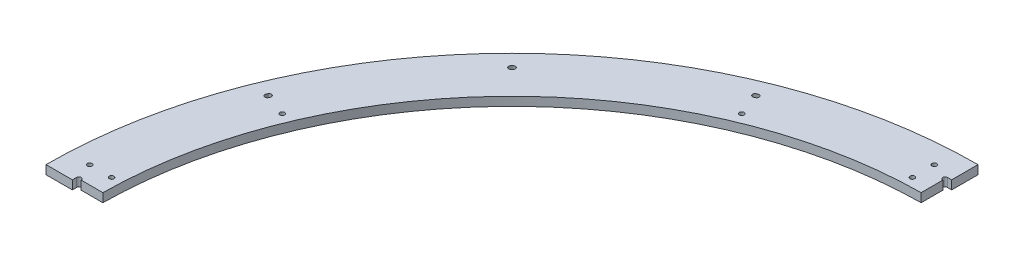
ISO-10303-21;
HEADER;
FILE_DESCRIPTION(('STEP AP214'),'2;1');
FILE_NAME('part.step','',(''),(''),'','','');
FILE_SCHEMA(('AUTOMOTIVE_DESIGN { 1 0 10303 214 1 1 1 1 }'));
ENDSEC;
DATA;
#1=APPLICATION_CONTEXT('core data for automotive mechanical design processes');
#2=APPLICATION_PROTOCOL_DEFINITION('international standard','automotive_design',2000,#1);
#3=PRODUCT_CONTEXT('',#1,'mechanical');
#4=PRODUCT('Part','Part','',(#3));
#5=PRODUCT_RELATED_PRODUCT_CATEGORY('part','',(#4));
#6=PRODUCT_DEFINITION_FORMATION('','',#4);
#7=PRODUCT_DEFINITION_CONTEXT('part definition',#1,'design');
#8=PRODUCT_DEFINITION('design','',#6,#7);
#9=PRODUCT_DEFINITION_SHAPE('','',#8);
#10=(LENGTH_UNIT() NAMED_UNIT(*) SI_UNIT(.MILLI.,.METRE.));
#11=(NAMED_UNIT(*) PLANE_ANGLE_UNIT() SI_UNIT($,.RADIAN.));
#12=(NAMED_UNIT(*) SI_UNIT($,.STERADIAN.) SOLID_ANGLE_UNIT());
#13=UNCERTAINTY_MEASURE_WITH_UNIT(LENGTH_MEASURE(1.E-05),#10,'distance_accuracy_value','');
#14=(GEOMETRIC_REPRESENTATION_CONTEXT(3) GLOBAL_UNCERTAINTY_ASSIGNED_CONTEXT((#13)) GLOBAL_UNIT_ASSIGNED_CONTEXT((#10,
#11,#12)) REPRESENTATION_CONTEXT('',''));
#15=CARTESIAN_POINT('',(0.,0.,0.));
#16=DIRECTION('',(0.,0.,1.));
#17=DIRECTION('',(1.,0.,0.));
#18=AXIS2_PLACEMENT_3D('',#15,#16,#17);
#19=CARTESIAN_POINT('',(0.,12.7,0.));
#20=DIRECTION('',(0.,-1.,0.));
#21=DIRECTION('',(0.,0.,-1.));
#22=AXIS2_PLACEMENT_3D('',#19,#20,#21);
#23=PLANE('',#22);
#24=CARTESIAN_POINT('',(0.,12.7,0.));
#25=DIRECTION('',(0.,1.,0.));
#26=DIRECTION('',(0.,0.,1.));
#27=AXIS2_PLACEMENT_3D('',#24,#25,#26);
#28=CIRCLE('',#27,652.6657);
#29=CARTESIAN_POINT('',(-602.990490798011,12.7,-249.749842770047));
#30=VERTEX_POINT('',#29);
#31=CARTESIAN_POINT('',(-603.807939634826,12.7,-247.767003433541));
#32=VERTEX_POINT('',#31);
#33=EDGE_CURVE('E211',#30,#32,#28,.T.);
#34=ORIENTED_EDGE('',*,*,#33,.F.);
#35=CARTESIAN_POINT('',(-599.869409858698,12.7,-248.457136689666));
#36=DIRECTION('',(0.,1.,0.));
#37=DIRECTION('',(0.,0.,1.));
#38=AXIS2_PLACEMENT_3D('',#35,#36,#37);
#39=CIRCLE('',#38,3.37820000000002);
#40=CARTESIAN_POINT('',(-596.748328919384,12.7,-247.164430609286));
#41=VERTEX_POINT('',#40);
#42=EDGE_CURVE('E47',#41,#30,#39,.T.);
#43=ORIENTED_EDGE('',*,*,#42,.F.);
#44=CARTESIAN_POINT('',(0.,12.7,0.));
#45=DIRECTION('',(0.,-1.,0.));
#46=DIRECTION('',(0.,0.,1.));
#47=AXIS2_PLACEMENT_3D('',#44,#45,#46);
#48=CIRCLE('',#47,645.9093);
#49=CARTESIAN_POINT('',(-597.557315519986,12.7,-245.20211763979));
#50=VERTEX_POINT('',#49);
#51=EDGE_CURVE('E202',#50,#41,#48,.T.);
#52=ORIENTED_EDGE('',*,*,#51,.F.);
#53=CARTESIAN_POINT('',(-600.682627577406,12.7,-246.484560536666));
#54=DIRECTION('',(0.,1.,0.));
#55=DIRECTION('',(0.,0.,1.));
#56=AXIS2_PLACEMENT_3D('',#53,#54,#55);
#57=CIRCLE('',#56,3.37819999999996);
#58=EDGE_CURVE('E205',#32,#50,#57,.T.);
#59=ORIENTED_EDGE('',*,*,#58,.F.);
#60=EDGE_LOOP('',(#34,#43,#52,#59));
#61=FACE_BOUND('',#60,.T.);
#62=CARTESIAN_POINT('',(0.,12.7,0.));
#63=DIRECTION('',(0.,1.,0.));
#64=DIRECTION('',(0.,0.,1.));
#65=AXIS2_PLACEMENT_3D('',#62,#63,#64);
#66=CIRCLE('',#65,652.6657);
#67=CARTESIAN_POINT('',(-460.745442176767,12.7,-462.261996566693));
#68=VERTEX_POINT('',#67);
#69=CARTESIAN_POINT('',(-462.261996566693,12.7,-460.745442176767));
#70=VERTEX_POINT('',#69);
#71=EDGE_CURVE('E237',#68,#70,#66,.T.);
#72=ORIENTED_EDGE('',*,*,#71,.F.);
#73=CARTESIAN_POINT('',(-458.360622118411,12.7,-459.869326817384));
#74=DIRECTION('',(0.,1.,0.));
#75=DIRECTION('',(0.,0.,1.));
#76=AXIS2_PLACEMENT_3D('',#73,#74,#75);
#77=CIRCLE('',#76,3.37819999999989);
#78=CARTESIAN_POINT('',(-455.975802060054,12.7,-457.476657068075));
#79=VERTEX_POINT('',#78);
#80=EDGE_CURVE('E55',#79,#68,#77,.T.);
#81=ORIENTED_EDGE('',*,*,#80,.F.);
#82=CARTESIAN_POINT('',(0.,12.7,0.));
#83=DIRECTION('',(0.,-1.,0.));
#84=DIRECTION('',(0.,0.,1.));
#85=AXIS2_PLACEMENT_3D('',#82,#83,#84);
#86=CIRCLE('',#85,645.9093);
#87=CARTESIAN_POINT('',(-457.476657068075,12.7,-455.975802060054));
#88=VERTEX_POINT('',#87);
#89=EDGE_CURVE('E226',#88,#79,#86,.T.);
#90=ORIENTED_EDGE('',*,*,#89,.F.);
#91=CARTESIAN_POINT('',(-459.869326817384,12.7,-458.360622118411));
#92=DIRECTION('',(0.,1.,0.));
#93=DIRECTION('',(0.,0.,1.));
#94=AXIS2_PLACEMENT_3D('',#91,#92,#93);
#95=CIRCLE('',#94,3.37819999999989);
#96=EDGE_CURVE('E241',#70,#88,#95,.T.);
#97=ORIENTED_EDGE('',*,*,#96,.F.);
#98=EDGE_LOOP('',(#72,#81,#90,#97));
#99=FACE_BOUND('',#98,.T.);
#100=CARTESIAN_POINT('',(0.,12.7,0.));
#101=DIRECTION('',(0.,1.,0.));
#102=DIRECTION('',(0.,0.,1.));
#103=AXIS2_PLACEMENT_3D('',#100,#101,#102);
#104=CIRCLE('',#103,652.6657);
#105=CARTESIAN_POINT('',(-247.767003433541,12.7,-603.807939634826));
#106=VERTEX_POINT('',#105);
#107=CARTESIAN_POINT('',(-249.749842770047,12.7,-602.990490798011));
#108=VERTEX_POINT('',#107);
#109=EDGE_CURVE('E268',#106,#108,#104,.T.);
#110=ORIENTED_EDGE('',*,*,#109,.F.);
#111=CARTESIAN_POINT('',(-246.484560536666,12.7,-600.682627577406));
#112=DIRECTION('',(0.,1.,0.));
#113=DIRECTION('',(0.,0.,1.));
#114=AXIS2_PLACEMENT_3D('',#111,#112,#113);
#115=CIRCLE('',#114,3.37819999999987);
#116=CARTESIAN_POINT('',(-245.202117639791,12.7,-597.557315519986));
#117=VERTEX_POINT('',#116);
#118=EDGE_CURVE('E266',#117,#106,#115,.T.);
#119=ORIENTED_EDGE('',*,*,#118,.F.);
#120=CARTESIAN_POINT('',(0.,12.7,0.));
#121=DIRECTION('',(0.,-1.,0.));
#122=DIRECTION('',(0.,0.,1.));
#123=AXIS2_PLACEMENT_3D('',#120,#121,#122);
#124=CIRCLE('',#123,645.9093);
#125=CARTESIAN_POINT('',(-247.164430609286,12.7,-596.748328919384));
#126=VERTEX_POINT('',#125);
#127=EDGE_CURVE('E256',#126,#117,#124,.T.);
#128=ORIENTED_EDGE('',*,*,#127,.F.);
#129=CARTESIAN_POINT('',(-248.457136689666,12.7,-599.869409858698));
#130=DIRECTION('',(0.,1.,0.));
#131=DIRECTION('',(0.,0.,1.));
#132=AXIS2_PLACEMENT_3D('',#129,#130,#131);
#133=CIRCLE('',#132,3.3781999999999);
#134=EDGE_CURVE('E271',#108,#126,#133,.T.);
#135=ORIENTED_EDGE('',*,*,#134,.F.);
#136=EDGE_LOOP('',(#110,#119,#128,#135));
#137=FACE_BOUND('',#136,.T.);
#138=CARTESIAN_POINT('',(-31.75,12.7,-642.9375));
#139=DIRECTION('',(0.,1.,0.));
#140=DIRECTION('',(0.,0.,1.));
#141=AXIS2_PLACEMENT_3D('',#138,#139,#140);
#142=CIRCLE('',#141,3.3782);
#143=CARTESIAN_POINT('',(-31.75,12.7,-639.5593));
#144=VERTEX_POINT('',#143);
#145=EDGE_CURVE('E303',#144,#144,#142,.T.);
#146=ORIENTED_EDGE('',*,*,#145,.F.);
#147=EDGE_LOOP('',(#146));
#148=FACE_BOUND('',#147,.T.);
#149=CARTESIAN_POINT('',(-31.75,12.7,-611.1875));
#150=DIRECTION('',(0.,1.,0.));
#151=DIRECTION('',(0.,0.,1.));
#152=AXIS2_PLACEMENT_3D('',#149,#150,#151);
#153=CIRCLE('',#152,3.3782);
#154=CARTESIAN_POINT('',(-31.75,12.7,-607.8093));
#155=VERTEX_POINT('',#154);
#156=EDGE_CURVE('E309',#155,#155,#153,.T.);
#157=ORIENTED_EDGE('',*,*,#156,.F.);
#158=EDGE_LOOP('',(#157));
#159=FACE_BOUND('',#158,.T.);
#160=CARTESIAN_POINT('',(-611.1875,12.7,-31.75));
#161=DIRECTION('',(0.,1.,0.));
#162=DIRECTION('',(0.,0.,1.));
#163=AXIS2_PLACEMENT_3D('',#160,#161,#162);
#164=CIRCLE('',#163,3.3782);
#165=CARTESIAN_POINT('',(-611.1875,12.7,-28.3718));
#166=VERTEX_POINT('',#165);
#167=EDGE_CURVE('E315',#166,#166,#164,.T.);
#168=ORIENTED_EDGE('',*,*,#167,.F.);
#169=EDGE_LOOP('',(#168));
#170=FACE_BOUND('',#169,.T.);
#171=CARTESIAN_POINT('',(-642.9375,12.7,-31.75));
#172=DIRECTION('',(0.,1.,0.));
#173=DIRECTION('',(0.,0.,1.));
#174=AXIS2_PLACEMENT_3D('',#171,#172,#173);
#175=CIRCLE('',#174,3.3782);
#176=CARTESIAN_POINT('',(-642.9375,12.7,-28.3718));
#177=VERTEX_POINT('',#176);
#178=EDGE_CURVE('E321',#177,#177,#175,.T.);
#179=ORIENTED_EDGE('',*,*,#178,.F.);
#180=EDGE_LOOP('',(#179));
#181=FACE_BOUND('',#180,.T.);
#182=CARTESIAN_POINT('',(-567.596939292465,12.7,-235.106350216397));
#183=DIRECTION('',(0.,1.,0.));
#184=DIRECTION('',(0.,0.,1.));
#185=AXIS2_PLACEMENT_3D('',#182,#183,#184);
#186=CIRCLE('',#185,3.3782);
#187=CARTESIAN_POINT('',(-567.596939292465,12.7,-231.728150216397));
#188=VERTEX_POINT('',#187);
#189=EDGE_CURVE('E327',#188,#188,#186,.T.);
#190=ORIENTED_EDGE('',*,*,#189,.F.);
#191=EDGE_LOOP('',(#190));
#192=FACE_BOUND('',#191,.T.);
#193=CARTESIAN_POINT('',(-235.106350216398,12.7,-567.596939292465));
#194=DIRECTION('',(0.,1.,0.));
#195=DIRECTION('',(0.,0.,1.));
#196=AXIS2_PLACEMENT_3D('',#193,#194,#195);
#197=CIRCLE('',#196,3.3782);
#198=CARTESIAN_POINT('',(-235.106350216398,12.7,-564.218739292465));
#199=VERTEX_POINT('',#198);
#200=EDGE_CURVE('E333',#199,#199,#197,.T.);
#201=ORIENTED_EDGE('',*,*,#200,.F.);
#202=EDGE_LOOP('',(#201));
#203=FACE_BOUND('',#202,.T.);
#204=DIRECTION('',(-1.,0.,0.));
#205=VECTOR('',#204,1.);
#206=CARTESIAN_POINT('',(-6.35,12.7,-636.5875));
#207=LINE('',#206,#205);
#208=CARTESIAN_POINT('',(-0.317499999999959,12.7,-636.5875));
#209=VERTEX_POINT('',#208);
#210=CARTESIAN_POINT('',(-6.35,12.7,-636.5875));
#211=VERTEX_POINT('',#210);
#212=EDGE_CURVE('E356',#209,#211,#207,.T.);
#213=ORIENTED_EDGE('',*,*,#212,.F.);
#214=DIRECTION('',(0.,0.,1.));
#215=VECTOR('',#214,1.);
#216=CARTESIAN_POINT('',(-0.317499999999959,12.7,-674.6875));
#217=LINE('',#216,#215);
#218=CARTESIAN_POINT('',(-0.317499999999959,12.7,-674.687425294113));
#219=VERTEX_POINT('',#218);
#220=EDGE_CURVE('E287',#219,#209,#217,.T.);
#221=ORIENTED_EDGE('',*,*,#220,.F.);
#222=CARTESIAN_POINT('',(0.,12.7,0.));
#223=DIRECTION('',(0.,1.,0.));
#224=DIRECTION('',(0.,0.,-1.));
#225=AXIS2_PLACEMENT_3D('',#222,#223,#224);
#226=CIRCLE('',#225,674.6875);
#227=CARTESIAN_POINT('',(-674.687425294113,12.7,-0.317499999999971));
#228=VERTEX_POINT('',#227);
#229=EDGE_CURVE('E40',#219,#228,#226,.T.);
#230=ORIENTED_EDGE('',*,*,#229,.T.);
#231=DIRECTION('',(-1.,0.,0.));
#232=VECTOR('',#231,1.);
#233=CARTESIAN_POINT('',(-674.6875,12.7,-0.317499999999971));
#234=LINE('',#233,#232);
#235=CARTESIAN_POINT('',(-636.5875,12.7,-0.317500000000082));
#236=VERTEX_POINT('',#235);
#237=EDGE_CURVE('E218',#236,#228,#234,.T.);
#238=ORIENTED_EDGE('',*,*,#237,.F.);
#239=DIRECTION('',(0.,0.,1.));
#240=VECTOR('',#239,1.);
#241=CARTESIAN_POINT('',(-636.5875,12.7,6.35000000000012));
#242=LINE('',#241,#240);
#243=CARTESIAN_POINT('',(-636.5875,12.7,-6.34999999999988));
#244=VERTEX_POINT('',#243);
#245=EDGE_CURVE('E373',#244,#236,#242,.T.);
#246=ORIENTED_EDGE('',*,*,#245,.F.);
#247=CARTESIAN_POINT('',(-633.1585,12.7,-6.34999999999988));
#248=DIRECTION('',(0.,1.,0.));
#249=DIRECTION('',(0.,0.,1.));
#250=AXIS2_PLACEMENT_3D('',#247,#248,#249);
#251=CIRCLE('',#250,3.429);
#252=CARTESIAN_POINT('',(-629.7295,12.7,-6.34999999999988));
#253=VERTEX_POINT('',#252);
#254=EDGE_CURVE('E344',#253,#244,#251,.T.);
#255=ORIENTED_EDGE('',*,*,#254,.F.);
#256=DIRECTION('',(-1.,0.,0.));
#257=VECTOR('',#256,1.);
#258=CARTESIAN_POINT('',(-598.453812049226,12.7,-6.34999999999989));
#259=LINE('',#258,#257);
#260=CARTESIAN_POINT('',(-598.453812049226,12.7,-6.34999999999989));
#261=VERTEX_POINT('',#260);
#262=EDGE_CURVE('E352',#261,#253,#259,.T.);
#263=ORIENTED_EDGE('',*,*,#262,.F.);
#264=CARTESIAN_POINT('',(0.,12.7,0.));
#265=DIRECTION('',(0.,-1.,0.));
#266=DIRECTION('',(0.,0.,-1.));
#267=AXIS2_PLACEMENT_3D('',#264,#265,#266);
#268=CIRCLE('',#267,598.4875);
#269=CARTESIAN_POINT('',(-6.35,12.7,-598.453812049226));
#270=VERTEX_POINT('',#269);
#271=EDGE_CURVE('E384',#261,#270,#268,.T.);
#272=ORIENTED_EDGE('',*,*,#271,.T.);
#273=DIRECTION('',(0.,0.,1.));
#274=VECTOR('',#273,1.);
#275=CARTESIAN_POINT('',(-6.35,12.7,-598.453812049226));
#276=LINE('',#275,#274);
#277=CARTESIAN_POINT('',(-6.35,12.7,-629.7295));
#278=VERTEX_POINT('',#277);
#279=EDGE_CURVE('E359',#278,#270,#276,.T.);
#280=ORIENTED_EDGE('',*,*,#279,.F.);
#281=CARTESIAN_POINT('',(-6.35,12.7,-633.1585));
#282=DIRECTION('',(0.,1.,0.));
#283=DIRECTION('',(0.,0.,1.));
#284=AXIS2_PLACEMENT_3D('',#281,#282,#283);
#285=CIRCLE('',#284,3.429);
#286=EDGE_CURVE('E346',#211,#278,#285,.T.);
#287=ORIENTED_EDGE('',*,*,#286,.F.);
#288=EDGE_LOOP('',(#213,#221,#230,#238,#246,#255,#263,#272,#280,#287));
#289=FACE_BOUND('',#288,.T.);
#290=ADVANCED_FACE('F32',(#61,#99,#137,#148,#159,#170,#181,#192,#203,#289),#23,.F.);
#291=CARTESIAN_POINT('',(0.,0.,0.));
#292=DIRECTION('',(0.,-1.,0.));
#293=DIRECTION('',(0.,0.,-1.));
#294=AXIS2_PLACEMENT_3D('',#291,#292,#293);
#295=PLANE('',#294);
#296=CARTESIAN_POINT('',(-599.869409858698,0.,-248.457136689666));
#297=DIRECTION('',(0.,1.,0.));
#298=DIRECTION('',(0.,0.,1.));
#299=AXIS2_PLACEMENT_3D('',#296,#297,#298);
#300=CIRCLE('',#299,3.37820000000002);
#301=CARTESIAN_POINT('',(-596.748328919384,0.,-247.164430609286));
#302=VERTEX_POINT('',#301);
#303=CARTESIAN_POINT('',(-602.990490798011,0.,-249.749842770047));
#304=VERTEX_POINT('',#303);
#305=EDGE_CURVE('E183',#302,#304,#300,.T.);
#306=ORIENTED_EDGE('',*,*,#305,.T.);
#307=CARTESIAN_POINT('',(0.,0.,0.));
#308=DIRECTION('',(0.,1.,0.));
#309=DIRECTION('',(0.,0.,1.));
#310=AXIS2_PLACEMENT_3D('',#307,#308,#309);
#311=CIRCLE('',#310,652.6657);
#312=CARTESIAN_POINT('',(-603.807939634826,0.,-247.767003433541));
#313=VERTEX_POINT('',#312);
#314=EDGE_CURVE('E193',#304,#313,#311,.T.);
#315=ORIENTED_EDGE('',*,*,#314,.T.);
#316=CARTESIAN_POINT('',(-600.682627577406,0.,-246.484560536666));
#317=DIRECTION('',(0.,1.,0.));
#318=DIRECTION('',(0.,0.,1.));
#319=AXIS2_PLACEMENT_3D('',#316,#317,#318);
#320=CIRCLE('',#319,3.37819999999996);
#321=CARTESIAN_POINT('',(-597.557315519986,0.,-245.20211763979));
#322=VERTEX_POINT('',#321);
#323=EDGE_CURVE('E197',#313,#322,#320,.T.);
#324=ORIENTED_EDGE('',*,*,#323,.T.);
#325=CARTESIAN_POINT('',(0.,0.,0.));
#326=DIRECTION('',(0.,-1.,0.));
#327=DIRECTION('',(0.,0.,1.));
#328=AXIS2_PLACEMENT_3D('',#325,#326,#327);
#329=CIRCLE('',#328,645.9093);
#330=EDGE_CURVE('E189',#322,#302,#329,.T.);
#331=ORIENTED_EDGE('',*,*,#330,.T.);
#332=EDGE_LOOP('',(#306,#315,#324,#331));
#333=FACE_BOUND('',#332,.T.);
#334=CARTESIAN_POINT('',(-458.360622118411,0.,-459.869326817384));
#335=DIRECTION('',(0.,1.,0.));
#336=DIRECTION('',(0.,0.,1.));
#337=AXIS2_PLACEMENT_3D('',#334,#335,#336);
#338=CIRCLE('',#337,3.37819999999989);
#339=CARTESIAN_POINT('',(-455.975802060054,0.,-457.476657068075));
#340=VERTEX_POINT('',#339);
#341=CARTESIAN_POINT('',(-460.745442176767,0.,-462.261996566693));
#342=VERTEX_POINT('',#341);
#343=EDGE_CURVE('E222',#340,#342,#338,.T.);
#344=ORIENTED_EDGE('',*,*,#343,.T.);
#345=CARTESIAN_POINT('',(0.,0.,0.));
#346=DIRECTION('',(0.,1.,0.));
#347=DIRECTION('',(0.,0.,1.));
#348=AXIS2_PLACEMENT_3D('',#345,#346,#347);
#349=CIRCLE('',#348,652.6657);
#350=CARTESIAN_POINT('',(-462.261996566693,0.,-460.745442176767));
#351=VERTEX_POINT('',#350);
#352=EDGE_CURVE('E225',#342,#351,#349,.T.);
#353=ORIENTED_EDGE('',*,*,#352,.T.);
#354=CARTESIAN_POINT('',(-459.869326817384,0.,-458.360622118411));
#355=DIRECTION('',(0.,1.,0.));
#356=DIRECTION('',(0.,0.,1.));
#357=AXIS2_PLACEMENT_3D('',#354,#355,#356);
#358=CIRCLE('',#357,3.37819999999989);
#359=CARTESIAN_POINT('',(-457.476657068075,0.,-455.975802060054));
#360=VERTEX_POINT('',#359);
#361=EDGE_CURVE('E229',#351,#360,#358,.T.);
#362=ORIENTED_EDGE('',*,*,#361,.T.);
#363=CARTESIAN_POINT('',(0.,0.,0.));
#364=DIRECTION('',(0.,-1.,0.));
#365=DIRECTION('',(0.,0.,1.));
#366=AXIS2_PLACEMENT_3D('',#363,#364,#365);
#367=CIRCLE('',#366,645.9093);
#368=EDGE_CURVE('E232',#360,#340,#367,.T.);
#369=ORIENTED_EDGE('',*,*,#368,.T.);
#370=EDGE_LOOP('',(#344,#353,#362,#369));
#371=FACE_BOUND('',#370,.T.);
#372=CARTESIAN_POINT('',(-246.484560536666,0.,-600.682627577406));
#373=DIRECTION('',(0.,1.,0.));
#374=DIRECTION('',(0.,0.,1.));
#375=AXIS2_PLACEMENT_3D('',#372,#373,#374);
#376=CIRCLE('',#375,3.37819999999987);
#377=CARTESIAN_POINT('',(-245.202117639791,0.,-597.557315519986));
#378=VERTEX_POINT('',#377);
#379=CARTESIAN_POINT('',(-247.767003433541,0.,-603.807939634826));
#380=VERTEX_POINT('',#379);
#381=EDGE_CURVE('E252',#378,#380,#376,.T.);
#382=ORIENTED_EDGE('',*,*,#381,.T.);
#383=CARTESIAN_POINT('',(0.,0.,0.));
#384=DIRECTION('',(0.,1.,0.));
#385=DIRECTION('',(0.,0.,1.));
#386=AXIS2_PLACEMENT_3D('',#383,#384,#385);
#387=CIRCLE('',#386,652.6657);
#388=CARTESIAN_POINT('',(-249.749842770047,0.,-602.990490798011));
#389=VERTEX_POINT('',#388);
#390=EDGE_CURVE('E255',#380,#389,#387,.T.);
#391=ORIENTED_EDGE('',*,*,#390,.T.);
#392=CARTESIAN_POINT('',(-248.457136689666,0.,-599.869409858698));
#393=DIRECTION('',(0.,1.,0.));
#394=DIRECTION('',(0.,0.,1.));
#395=AXIS2_PLACEMENT_3D('',#392,#393,#394);
#396=CIRCLE('',#395,3.3781999999999);
#397=CARTESIAN_POINT('',(-247.164430609286,0.,-596.748328919384));
#398=VERTEX_POINT('',#397);
#399=EDGE_CURVE('E259',#389,#398,#396,.T.);
#400=ORIENTED_EDGE('',*,*,#399,.T.);
#401=CARTESIAN_POINT('',(0.,0.,0.));
#402=DIRECTION('',(0.,-1.,0.));
#403=DIRECTION('',(0.,0.,1.));
#404=AXIS2_PLACEMENT_3D('',#401,#402,#403);
#405=CIRCLE('',#404,645.9093);
#406=EDGE_CURVE('E262',#398,#378,#405,.T.);
#407=ORIENTED_EDGE('',*,*,#406,.T.);
#408=EDGE_LOOP('',(#382,#391,#400,#407));
#409=FACE_BOUND('',#408,.T.);
#410=DIRECTION('',(0.,0.,1.));
#411=VECTOR('',#410,1.);
#412=CARTESIAN_POINT('',(-0.317499999999959,0.,-674.6875));
#413=LINE('',#412,#411);
#414=CARTESIAN_POINT('',(-0.317499999999959,0.,-674.687425294113));
#415=VERTEX_POINT('',#414);
#416=CARTESIAN_POINT('',(-0.317499999999954,0.,-636.5875));
#417=VERTEX_POINT('',#416);
#418=EDGE_CURVE('E283',#415,#417,#413,.T.);
#419=ORIENTED_EDGE('',*,*,#418,.T.);
#420=DIRECTION('',(-1.,0.,0.));
#421=VECTOR('',#420,1.);
#422=CARTESIAN_POINT('',(-6.35,0.,-636.5875));
#423=LINE('',#422,#421);
#424=CARTESIAN_POINT('',(-6.35,0.,-636.5875));
#425=VERTEX_POINT('',#424);
#426=EDGE_CURVE('E355',#417,#425,#423,.T.);
#427=ORIENTED_EDGE('',*,*,#426,.T.);
#428=CARTESIAN_POINT('',(-6.35,0.,-633.1585));
#429=DIRECTION('',(0.,1.,0.));
#430=DIRECTION('',(0.,0.,1.));
#431=AXIS2_PLACEMENT_3D('',#428,#429,#430);
#432=CIRCLE('',#431,3.429);
#433=CARTESIAN_POINT('',(-6.35,0.,-629.7295));
#434=VERTEX_POINT('',#433);
#435=EDGE_CURVE('E339',#425,#434,#432,.T.);
#436=ORIENTED_EDGE('',*,*,#435,.T.);
#437=DIRECTION('',(0.,0.,1.));
#438=VECTOR('',#437,1.);
#439=CARTESIAN_POINT('',(-6.35,0.,-598.453812049226));
#440=LINE('',#439,#438);
#441=CARTESIAN_POINT('',(-6.35,0.,-598.453812049226));
#442=VERTEX_POINT('',#441);
#443=EDGE_CURVE('E353',#434,#442,#440,.T.);
#444=ORIENTED_EDGE('',*,*,#443,.T.);
#445=CARTESIAN_POINT('',(0.,0.,0.));
#446=DIRECTION('',(0.,-1.,0.));
#447=DIRECTION('',(0.,0.,-1.));
#448=AXIS2_PLACEMENT_3D('',#445,#446,#447);
#449=CIRCLE('',#448,598.4875);
#450=CARTESIAN_POINT('',(-598.453812049226,0.,-6.34999999999989));
#451=VERTEX_POINT('',#450);
#452=EDGE_CURVE('E366',#451,#442,#449,.T.);
#453=ORIENTED_EDGE('',*,*,#452,.F.);
#454=DIRECTION('',(-1.,0.,0.));
#455=VECTOR('',#454,1.);
#456=CARTESIAN_POINT('',(-598.453812049226,0.,-6.34999999999989));
#457=LINE('',#456,#455);
#458=CARTESIAN_POINT('',(-629.7295,0.,-6.34999999999988));
#459=VERTEX_POINT('',#458);
#460=EDGE_CURVE('E369',#451,#459,#457,.T.);
#461=ORIENTED_EDGE('',*,*,#460,.T.);
#462=CARTESIAN_POINT('',(-633.1585,0.,-6.34999999999988));
#463=DIRECTION('',(0.,1.,0.));
#464=DIRECTION('',(0.,0.,1.));
#465=AXIS2_PLACEMENT_3D('',#462,#463,#464);
#466=CIRCLE('',#465,3.429);
#467=CARTESIAN_POINT('',(-636.5875,0.,-6.34999999999988));
#468=VERTEX_POINT('',#467);
#469=EDGE_CURVE('E340',#459,#468,#466,.T.);
#470=ORIENTED_EDGE('',*,*,#469,.T.);
#471=DIRECTION('',(0.,0.,1.));
#472=VECTOR('',#471,1.);
#473=CARTESIAN_POINT('',(-636.5875,0.,6.35000000000012));
#474=LINE('',#473,#472);
#475=CARTESIAN_POINT('',(-636.5875,0.,-0.317500000000082));
#476=VERTEX_POINT('',#475);
#477=EDGE_CURVE('E372',#468,#476,#474,.T.);
#478=ORIENTED_EDGE('',*,*,#477,.T.);
#479=DIRECTION('',(-1.,0.,0.));
#480=VECTOR('',#479,1.);
#481=CARTESIAN_POINT('',(-674.6875,0.,-0.317499999999971));
#482=LINE('',#481,#480);
#483=CARTESIAN_POINT('',(-674.687425294113,0.,-0.317499999999971));
#484=VERTEX_POINT('',#483);
#485=EDGE_CURVE('E293',#476,#484,#482,.T.);
#486=ORIENTED_EDGE('',*,*,#485,.T.);
#487=CARTESIAN_POINT('',(0.,0.,0.));
#488=DIRECTION('',(0.,1.,0.));
#489=DIRECTION('',(0.,0.,-1.));
#490=AXIS2_PLACEMENT_3D('',#487,#488,#489);
#491=CIRCLE('',#490,674.6875);
#492=EDGE_CURVE('E387',#415,#484,#491,.T.);
#493=ORIENTED_EDGE('',*,*,#492,.F.);
#494=EDGE_LOOP('',(#419,#427,#436,#444,#453,#461,#470,#478,#486,#493));
#495=FACE_BOUND('',#494,.T.);
#496=CARTESIAN_POINT('',(-31.75,0.,-642.9375));
#497=DIRECTION('',(0.,1.,0.));
#498=DIRECTION('',(0.,0.,1.));
#499=AXIS2_PLACEMENT_3D('',#496,#497,#498);
#500=CIRCLE('',#499,3.3782);
#501=CARTESIAN_POINT('',(-31.75,0.,-639.5593));
#502=VERTEX_POINT('',#501);
#503=EDGE_CURVE('E306',#502,#502,#500,.T.);
#504=ORIENTED_EDGE('',*,*,#503,.T.);
#505=EDGE_LOOP('',(#504));
#506=FACE_BOUND('',#505,.T.);
#507=CARTESIAN_POINT('',(-31.75,0.,-611.1875));
#508=DIRECTION('',(0.,1.,0.));
#509=DIRECTION('',(0.,0.,1.));
#510=AXIS2_PLACEMENT_3D('',#507,#508,#509);
#511=CIRCLE('',#510,3.3782);
#512=CARTESIAN_POINT('',(-31.75,0.,-607.8093));
#513=VERTEX_POINT('',#512);
#514=EDGE_CURVE('E312',#513,#513,#511,.T.);
#515=ORIENTED_EDGE('',*,*,#514,.T.);
#516=EDGE_LOOP('',(#515));
#517=FACE_BOUND('',#516,.T.);
#518=CARTESIAN_POINT('',(-611.1875,0.,-31.75));
#519=DIRECTION('',(0.,1.,0.));
#520=DIRECTION('',(0.,0.,1.));
#521=AXIS2_PLACEMENT_3D('',#518,#519,#520);
#522=CIRCLE('',#521,3.3782);
#523=CARTESIAN_POINT('',(-611.1875,0.,-28.3718));
#524=VERTEX_POINT('',#523);
#525=EDGE_CURVE('E318',#524,#524,#522,.T.);
#526=ORIENTED_EDGE('',*,*,#525,.T.);
#527=EDGE_LOOP('',(#526));
#528=FACE_BOUND('',#527,.T.);
#529=CARTESIAN_POINT('',(-642.9375,0.,-31.75));
#530=DIRECTION('',(0.,1.,0.));
#531=DIRECTION('',(0.,0.,1.));
#532=AXIS2_PLACEMENT_3D('',#529,#530,#531);
#533=CIRCLE('',#532,3.3782);
#534=CARTESIAN_POINT('',(-642.9375,0.,-28.3718));
#535=VERTEX_POINT('',#534);
#536=EDGE_CURVE('E324',#535,#535,#533,.T.);
#537=ORIENTED_EDGE('',*,*,#536,.T.);
#538=EDGE_LOOP('',(#537));
#539=FACE_BOUND('',#538,.T.);
#540=CARTESIAN_POINT('',(-567.596939292465,0.,-235.106350216397));
#541=DIRECTION('',(0.,1.,0.));
#542=DIRECTION('',(0.,0.,1.));
#543=AXIS2_PLACEMENT_3D('',#540,#541,#542);
#544=CIRCLE('',#543,3.3782);
#545=CARTESIAN_POINT('',(-567.596939292465,0.,-231.728150216397));
#546=VERTEX_POINT('',#545);
#547=EDGE_CURVE('E330',#546,#546,#544,.T.);
#548=ORIENTED_EDGE('',*,*,#547,.T.);
#549=EDGE_LOOP('',(#548));
#550=FACE_BOUND('',#549,.T.);
#551=CARTESIAN_POINT('',(-235.106350216398,0.,-567.596939292465));
#552=DIRECTION('',(0.,1.,0.));
#553=DIRECTION('',(0.,0.,1.));
#554=AXIS2_PLACEMENT_3D('',#551,#552,#553);
#555=CIRCLE('',#554,3.3782);
#556=CARTESIAN_POINT('',(-235.106350216398,0.,-564.218739292465));
#557=VERTEX_POINT('',#556);
#558=EDGE_CURVE('E336',#557,#557,#555,.T.);
#559=ORIENTED_EDGE('',*,*,#558,.T.);
#560=EDGE_LOOP('',(#559));
#561=FACE_BOUND('',#560,.T.);
#562=ADVANCED_FACE('F199',(#333,#371,#409,#495,#506,#517,#528,#539,#550,#561),#295,.T.);
#563=CARTESIAN_POINT('',(0.,12.7,0.));
#564=DIRECTION('',(0.,-1.,0.));
#565=DIRECTION('',(0.,0.,-1.));
#566=AXIS2_PLACEMENT_3D('',#563,#564,#565);
#567=CYLINDRICAL_SURFACE('',#566,598.4875);
#568=ORIENTED_EDGE('',*,*,#452,.T.);
#569=DIRECTION('',(0.,1.,0.));
#570=VECTOR('',#569,1.);
#571=CARTESIAN_POINT('',(-6.35,0.,-598.453812049226));
#572=LINE('',#571,#570);
#573=EDGE_CURVE('E358',#442,#270,#572,.T.);
#574=ORIENTED_EDGE('',*,*,#573,.T.);
#575=ORIENTED_EDGE('',*,*,#271,.F.);
#576=DIRECTION('',(0.,1.,0.));
#577=VECTOR('',#576,1.);
#578=CARTESIAN_POINT('',(-598.453812049226,0.,-6.34999999999989));
#579=LINE('',#578,#577);
#580=EDGE_CURVE('E376',#451,#261,#579,.T.);
#581=ORIENTED_EDGE('',*,*,#580,.F.);
#582=EDGE_LOOP('',(#568,#574,#575,#581));
#583=FACE_BOUND('',#582,.T.);
#584=ADVANCED_FACE('F34',(#583),#567,.F.);
#585=CARTESIAN_POINT('',(0.,12.7,0.));
#586=DIRECTION('',(0.,-1.,0.));
#587=DIRECTION('',(0.,0.,-1.));
#588=AXIS2_PLACEMENT_3D('',#585,#586,#587);
#589=CYLINDRICAL_SURFACE('',#588,674.6875);
#590=ORIENTED_EDGE('',*,*,#229,.F.);
#591=DIRECTION('',(0.,-1.,0.));
#592=VECTOR('',#591,1.);
#593=CARTESIAN_POINT('',(-0.317499999999959,12.7,-674.687425294113));
#594=LINE('',#593,#592);
#595=EDGE_CURVE('E292',#219,#415,#594,.T.);
#596=ORIENTED_EDGE('',*,*,#595,.T.);
#597=ORIENTED_EDGE('',*,*,#492,.T.);
#598=DIRECTION('',(0.,-1.,0.));
#599=VECTOR('',#598,1.);
#600=CARTESIAN_POINT('',(-674.687425294113,12.7,-0.317499999999971));
#601=LINE('',#600,#599);
#602=EDGE_CURVE('E300',#484,#228,#601,.F.);
#603=ORIENTED_EDGE('',*,*,#602,.T.);
#604=EDGE_LOOP('',(#590,#596,#597,#603));
#605=FACE_BOUND('',#604,.T.);
#606=ADVANCED_FACE('F395',(#605),#589,.T.);
#607=CARTESIAN_POINT('',(-636.5875,0.,6.35000000000012));
#608=DIRECTION('',(-1.,0.,0.));
#609=DIRECTION('',(0.,0.,1.));
#610=AXIS2_PLACEMENT_3D('',#607,#608,#609);
#611=PLANE('',#610);
#612=ORIENTED_EDGE('',*,*,#245,.T.);
#613=DIRECTION('',(0.,1.,0.));
#614=VECTOR('',#613,1.);
#615=CARTESIAN_POINT('',(-636.5875,0.,-0.317500000000082));
#616=LINE('',#615,#614);
#617=EDGE_CURVE('E289',#476,#236,#616,.T.);
#618=ORIENTED_EDGE('',*,*,#617,.F.);
#619=ORIENTED_EDGE('',*,*,#477,.F.);
#620=DIRECTION('',(0.,1.,0.));
#621=VECTOR('',#620,1.);
#622=CARTESIAN_POINT('',(-636.5875,0.,-6.34999999999988));
#623=LINE('',#622,#621);
#624=EDGE_CURVE('E361',#468,#244,#623,.T.);
#625=ORIENTED_EDGE('',*,*,#624,.T.);
#626=EDGE_LOOP('',(#612,#618,#619,#625));
#627=FACE_BOUND('',#626,.T.);
#628=ADVANCED_FACE('F405',(#627),#611,.F.);
#629=CARTESIAN_POINT('',(-598.453812049226,0.,-6.34999999999989));
#630=DIRECTION('',(0.,0.,-1.));
#631=DIRECTION('',(-1.,0.,0.));
#632=AXIS2_PLACEMENT_3D('',#629,#630,#631);
#633=PLANE('',#632);
#634=ORIENTED_EDGE('',*,*,#262,.T.);
#635=DIRECTION('',(0.,1.,0.));
#636=VECTOR('',#635,1.);
#637=CARTESIAN_POINT('',(-629.7295,0.,-6.34999999999988));
#638=LINE('',#637,#636);
#639=EDGE_CURVE('E11',#253,#459,#638,.F.);
#640=ORIENTED_EDGE('',*,*,#639,.T.);
#641=ORIENTED_EDGE('',*,*,#460,.F.);
#642=ORIENTED_EDGE('',*,*,#580,.T.);
#643=EDGE_LOOP('',(#634,#640,#641,#642));
#644=FACE_BOUND('',#643,.T.);
#645=ADVANCED_FACE('F431',(#644),#633,.F.);
#646=CARTESIAN_POINT('',(-6.35,0.,-598.453812049226));
#647=DIRECTION('',(-1.,0.,0.));
#648=DIRECTION('',(0.,0.,1.));
#649=AXIS2_PLACEMENT_3D('',#646,#647,#648);
#650=PLANE('',#649);
#651=ORIENTED_EDGE('',*,*,#443,.F.);
#652=DIRECTION('',(0.,1.,0.));
#653=VECTOR('',#652,1.);
#654=CARTESIAN_POINT('',(-6.35,0.,-629.7295));
#655=LINE('',#654,#653);
#656=EDGE_CURVE('E343',#434,#278,#655,.T.);
#657=ORIENTED_EDGE('',*,*,#656,.T.);
#658=ORIENTED_EDGE('',*,*,#279,.T.);
#659=ORIENTED_EDGE('',*,*,#573,.F.);
#660=EDGE_LOOP('',(#651,#657,#658,#659));
#661=FACE_BOUND('',#660,.T.);
#662=ADVANCED_FACE('F424',(#661),#650,.F.);
#663=CARTESIAN_POINT('',(-6.35,0.,-636.5875));
#664=DIRECTION('',(0.,0.,-1.));
#665=DIRECTION('',(-1.,0.,0.));
#666=AXIS2_PLACEMENT_3D('',#663,#664,#665);
#667=PLANE('',#666);
#668=ORIENTED_EDGE('',*,*,#426,.F.);
#669=DIRECTION('',(0.,1.,0.));
#670=VECTOR('',#669,1.);
#671=CARTESIAN_POINT('',(-0.317499999999954,0.,-636.5875));
#672=LINE('',#671,#670);
#673=EDGE_CURVE('E286',#417,#209,#672,.T.);
#674=ORIENTED_EDGE('',*,*,#673,.T.);
#675=ORIENTED_EDGE('',*,*,#212,.T.);
#676=DIRECTION('',(0.,1.,0.));
#677=VECTOR('',#676,1.);
#678=CARTESIAN_POINT('',(-6.35,0.,-636.5875));
#679=LINE('',#678,#677);
#680=EDGE_CURVE('E363',#425,#211,#679,.T.);
#681=ORIENTED_EDGE('',*,*,#680,.F.);
#682=EDGE_LOOP('',(#668,#674,#675,#681));
#683=FACE_BOUND('',#682,.T.);
#684=ADVANCED_FACE('F416',(#683),#667,.F.);
#685=CARTESIAN_POINT('',(-6.35,0.,-633.1585));
#686=DIRECTION('',(0.,1.,0.));
#687=DIRECTION('',(0.,0.,1.));
#688=AXIS2_PLACEMENT_3D('',#685,#686,#687);
#689=CYLINDRICAL_SURFACE('',#688,3.429);
#690=ORIENTED_EDGE('',*,*,#435,.F.);
#691=ORIENTED_EDGE('',*,*,#680,.T.);
#692=ORIENTED_EDGE('',*,*,#286,.T.);
#693=ORIENTED_EDGE('',*,*,#656,.F.);
#694=EDGE_LOOP('',(#690,#691,#692,#693));
#695=FACE_BOUND('',#694,.T.);
#696=ADVANCED_FACE('F421',(#695),#689,.F.);
#697=CARTESIAN_POINT('',(-633.1585,0.,-6.34999999999988));
#698=DIRECTION('',(0.,1.,0.));
#699=DIRECTION('',(0.,0.,1.));
#700=AXIS2_PLACEMENT_3D('',#697,#698,#699);
#701=CYLINDRICAL_SURFACE('',#700,3.429);
#702=ORIENTED_EDGE('',*,*,#469,.F.);
#703=ORIENTED_EDGE('',*,*,#639,.F.);
#704=ORIENTED_EDGE('',*,*,#254,.T.);
#705=ORIENTED_EDGE('',*,*,#624,.F.);
#706=EDGE_LOOP('',(#702,#703,#704,#705));
#707=FACE_BOUND('',#706,.T.);
#708=ADVANCED_FACE('F433',(#707),#701,.F.);
#709=CARTESIAN_POINT('',(-235.106350216398,12.7,-567.596939292465));
#710=DIRECTION('',(0.,1.,0.));
#711=DIRECTION('',(0.,0.,1.));
#712=AXIS2_PLACEMENT_3D('',#709,#710,#711);
#713=CYLINDRICAL_SURFACE('',#712,3.3782);
#714=ORIENTED_EDGE('',*,*,#558,.F.);
#715=EDGE_LOOP('',(#714));
#716=FACE_BOUND('',#715,.T.);
#717=ORIENTED_EDGE('',*,*,#200,.T.);
#718=EDGE_LOOP('',(#717));
#719=FACE_BOUND('',#718,.T.);
#720=ADVANCED_FACE('F435',(#716,#719),#713,.F.);
#721=CARTESIAN_POINT('',(-567.596939292465,12.7,-235.106350216397));
#722=DIRECTION('',(0.,1.,0.));
#723=DIRECTION('',(0.,0.,1.));
#724=AXIS2_PLACEMENT_3D('',#721,#722,#723);
#725=CYLINDRICAL_SURFACE('',#724,3.3782);
#726=ORIENTED_EDGE('',*,*,#547,.F.);
#727=EDGE_LOOP('',(#726));
#728=FACE_BOUND('',#727,.T.);
#729=ORIENTED_EDGE('',*,*,#189,.T.);
#730=EDGE_LOOP('',(#729));
#731=FACE_BOUND('',#730,.T.);
#732=ADVANCED_FACE('F441',(#728,#731),#725,.F.);
#733=CARTESIAN_POINT('',(-642.9375,12.7,-31.75));
#734=DIRECTION('',(0.,1.,0.));
#735=DIRECTION('',(0.,0.,1.));
#736=AXIS2_PLACEMENT_3D('',#733,#734,#735);
#737=CYLINDRICAL_SURFACE('',#736,3.3782);
#738=ORIENTED_EDGE('',*,*,#536,.F.);
#739=EDGE_LOOP('',(#738));
#740=FACE_BOUND('',#739,.T.);
#741=ORIENTED_EDGE('',*,*,#178,.T.);
#742=EDGE_LOOP('',(#741));
#743=FACE_BOUND('',#742,.T.);
#744=ADVANCED_FACE('F607',(#740,#743),#737,.F.);
#745=CARTESIAN_POINT('',(-611.1875,12.7,-31.75));
#746=DIRECTION('',(0.,1.,0.));
#747=DIRECTION('',(0.,0.,1.));
#748=AXIS2_PLACEMENT_3D('',#745,#746,#747);
#749=CYLINDRICAL_SURFACE('',#748,3.3782);
#750=ORIENTED_EDGE('',*,*,#525,.F.);
#751=EDGE_LOOP('',(#750));
#752=FACE_BOUND('',#751,.T.);
#753=ORIENTED_EDGE('',*,*,#167,.T.);
#754=EDGE_LOOP('',(#753));
#755=FACE_BOUND('',#754,.T.);
#756=ADVANCED_FACE('F603',(#752,#755),#749,.F.);
#757=CARTESIAN_POINT('',(-31.75,12.7,-611.1875));
#758=DIRECTION('',(0.,1.,0.));
#759=DIRECTION('',(0.,0.,1.));
#760=AXIS2_PLACEMENT_3D('',#757,#758,#759);
#761=CYLINDRICAL_SURFACE('',#760,3.3782);
#762=ORIENTED_EDGE('',*,*,#514,.F.);
#763=EDGE_LOOP('',(#762));
#764=FACE_BOUND('',#763,.T.);
#765=ORIENTED_EDGE('',*,*,#156,.T.);
#766=EDGE_LOOP('',(#765));
#767=FACE_BOUND('',#766,.T.);
#768=ADVANCED_FACE('F599',(#764,#767),#761,.F.);
#769=CARTESIAN_POINT('',(-31.75,12.7,-642.9375));
#770=DIRECTION('',(0.,1.,0.));
#771=DIRECTION('',(0.,0.,1.));
#772=AXIS2_PLACEMENT_3D('',#769,#770,#771);
#773=CYLINDRICAL_SURFACE('',#772,3.3782);
#774=ORIENTED_EDGE('',*,*,#503,.F.);
#775=EDGE_LOOP('',(#774));
#776=FACE_BOUND('',#775,.T.);
#777=ORIENTED_EDGE('',*,*,#145,.T.);
#778=EDGE_LOOP('',(#777));
#779=FACE_BOUND('',#778,.T.);
#780=ADVANCED_FACE('F595',(#776,#779),#773,.F.);
#781=CARTESIAN_POINT('',(-0.317499999999959,0.,-674.6875));
#782=DIRECTION('',(-1.,0.,0.));
#783=DIRECTION('',(0.,0.,1.));
#784=AXIS2_PLACEMENT_3D('',#781,#782,#783);
#785=PLANE('',#784);
#786=ORIENTED_EDGE('',*,*,#220,.T.);
#787=ORIENTED_EDGE('',*,*,#673,.F.);
#788=ORIENTED_EDGE('',*,*,#418,.F.);
#789=ORIENTED_EDGE('',*,*,#595,.F.);
#790=EDGE_LOOP('',(#786,#787,#788,#789));
#791=FACE_BOUND('',#790,.T.);
#792=ADVANCED_FACE('F414',(#791),#785,.F.);
#793=CARTESIAN_POINT('',(-674.6875,0.,-0.317499999999971));
#794=DIRECTION('',(0.,0.,-1.));
#795=DIRECTION('',(-1.,0.,0.));
#796=AXIS2_PLACEMENT_3D('',#793,#794,#795);
#797=PLANE('',#796);
#798=ORIENTED_EDGE('',*,*,#485,.F.);
#799=ORIENTED_EDGE('',*,*,#617,.T.);
#800=ORIENTED_EDGE('',*,*,#237,.T.);
#801=ORIENTED_EDGE('',*,*,#602,.F.);
#802=EDGE_LOOP('',(#798,#799,#800,#801));
#803=FACE_BOUND('',#802,.T.);
#804=ADVANCED_FACE('F402',(#803),#797,.F.);
#805=CARTESIAN_POINT('',(-246.484560536666,0.,-600.682627577406));
#806=DIRECTION('',(0.,1.,0.));
#807=DIRECTION('',(0.,0.,1.));
#808=AXIS2_PLACEMENT_3D('',#805,#806,#807);
#809=CYLINDRICAL_SURFACE('',#808,3.37819999999987);
#810=ORIENTED_EDGE('',*,*,#118,.T.);
#811=DIRECTION('',(0.,1.,0.));
#812=VECTOR('',#811,1.);
#813=CARTESIAN_POINT('',(-247.767003433541,0.,-603.807939634826));
#814=LINE('',#813,#812);
#815=EDGE_CURVE('E265',#380,#106,#814,.T.);
#816=ORIENTED_EDGE('',*,*,#815,.F.);
#817=ORIENTED_EDGE('',*,*,#381,.F.);
#818=DIRECTION('',(0.,1.,0.));
#819=VECTOR('',#818,1.);
#820=CARTESIAN_POINT('',(-245.202117639791,0.,-597.557315519986));
#821=LINE('',#820,#819);
#822=EDGE_CURVE('E238',#378,#117,#821,.T.);
#823=ORIENTED_EDGE('',*,*,#822,.T.);
#824=EDGE_LOOP('',(#810,#816,#817,#823));
#825=FACE_BOUND('',#824,.T.);
#826=ADVANCED_FACE('F476',(#825),#809,.F.);
#827=CARTESIAN_POINT('',(0.,0.,0.));
#828=DIRECTION('',(0.,1.,0.));
#829=DIRECTION('',(0.,0.,1.));
#830=AXIS2_PLACEMENT_3D('',#827,#828,#829);
#831=CYLINDRICAL_SURFACE('',#830,645.9093);
#832=ORIENTED_EDGE('',*,*,#127,.T.);
#833=ORIENTED_EDGE('',*,*,#822,.F.);
#834=ORIENTED_EDGE('',*,*,#406,.F.);
#835=DIRECTION('',(0.,1.,0.));
#836=VECTOR('',#835,1.);
#837=CARTESIAN_POINT('',(-247.164430609286,0.,-596.748328919384));
#838=LINE('',#837,#836);
#839=EDGE_CURVE('E277',#398,#126,#838,.T.);
#840=ORIENTED_EDGE('',*,*,#839,.T.);
#841=EDGE_LOOP('',(#832,#833,#834,#840));
#842=FACE_BOUND('',#841,.T.);
#843=ADVANCED_FACE('F481',(#842),#831,.T.);
#844=CARTESIAN_POINT('',(-248.457136689666,0.,-599.869409858698));
#845=DIRECTION('',(0.,1.,0.));
#846=DIRECTION('',(0.,0.,1.));
#847=AXIS2_PLACEMENT_3D('',#844,#845,#846);
#848=CYLINDRICAL_SURFACE('',#847,3.3781999999999);
#849=ORIENTED_EDGE('',*,*,#134,.T.);
#850=ORIENTED_EDGE('',*,*,#839,.F.);
#851=ORIENTED_EDGE('',*,*,#399,.F.);
#852=DIRECTION('',(0.,1.,0.));
#853=VECTOR('',#852,1.);
#854=CARTESIAN_POINT('',(-249.749842770047,0.,-602.990490798011));
#855=LINE('',#854,#853);
#856=EDGE_CURVE('E279',#389,#108,#855,.T.);
#857=ORIENTED_EDGE('',*,*,#856,.T.);
#858=EDGE_LOOP('',(#849,#850,#851,#857));
#859=FACE_BOUND('',#858,.T.);
#860=ADVANCED_FACE('F493',(#859),#848,.F.);
#861=CARTESIAN_POINT('',(0.,0.,0.));
#862=DIRECTION('',(0.,1.,0.));
#863=DIRECTION('',(0.,0.,1.));
#864=AXIS2_PLACEMENT_3D('',#861,#862,#863);
#865=CYLINDRICAL_SURFACE('',#864,652.6657);
#866=ORIENTED_EDGE('',*,*,#109,.T.);
#867=ORIENTED_EDGE('',*,*,#856,.F.);
#868=ORIENTED_EDGE('',*,*,#390,.F.);
#869=ORIENTED_EDGE('',*,*,#815,.T.);
#870=EDGE_LOOP('',(#866,#867,#868,#869));
#871=FACE_BOUND('',#870,.T.);
#872=ADVANCED_FACE('F503',(#871),#865,.F.);
#873=CARTESIAN_POINT('',(-458.360622118411,0.,-459.869326817384));
#874=DIRECTION('',(0.,1.,0.));
#875=DIRECTION('',(0.,0.,1.));
#876=AXIS2_PLACEMENT_3D('',#873,#874,#875);
#877=CYLINDRICAL_SURFACE('',#876,3.37819999999989);
#878=ORIENTED_EDGE('',*,*,#80,.T.);
#879=DIRECTION('',(0.,1.,0.));
#880=VECTOR('',#879,1.);
#881=CARTESIAN_POINT('',(-460.745442176767,0.,-462.261996566693));
#882=LINE('',#881,#880);
#883=EDGE_CURVE('E235',#342,#68,#882,.T.);
#884=ORIENTED_EDGE('',*,*,#883,.F.);
#885=ORIENTED_EDGE('',*,*,#343,.F.);
#886=DIRECTION('',(0.,1.,0.));
#887=VECTOR('',#886,1.);
#888=CARTESIAN_POINT('',(-455.975802060054,0.,-457.476657068075));
#889=LINE('',#888,#887);
#890=EDGE_CURVE('E212',#340,#79,#889,.T.);
#891=ORIENTED_EDGE('',*,*,#890,.T.);
#892=EDGE_LOOP('',(#878,#884,#885,#891));
#893=FACE_BOUND('',#892,.T.);
#894=ADVANCED_FACE('F513',(#893),#877,.F.);
#895=CARTESIAN_POINT('',(0.,0.,0.));
#896=DIRECTION('',(0.,1.,0.));
#897=DIRECTION('',(0.,0.,1.));
#898=AXIS2_PLACEMENT_3D('',#895,#896,#897);
#899=CYLINDRICAL_SURFACE('',#898,645.9093);
#900=ORIENTED_EDGE('',*,*,#89,.T.);
#901=ORIENTED_EDGE('',*,*,#890,.F.);
#902=ORIENTED_EDGE('',*,*,#368,.F.);
#903=DIRECTION('',(0.,1.,0.));
#904=VECTOR('',#903,1.);
#905=CARTESIAN_POINT('',(-457.476657068075,0.,-455.975802060054));
#906=LINE('',#905,#904);
#907=EDGE_CURVE('E247',#360,#88,#906,.T.);
#908=ORIENTED_EDGE('',*,*,#907,.T.);
#909=EDGE_LOOP('',(#900,#901,#902,#908));
#910=FACE_BOUND('',#909,.T.);
#911=ADVANCED_FACE('F523',(#910),#899,.T.);
#912=CARTESIAN_POINT('',(-459.869326817384,0.,-458.360622118411));
#913=DIRECTION('',(0.,1.,0.));
#914=DIRECTION('',(0.,0.,1.));
#915=AXIS2_PLACEMENT_3D('',#912,#913,#914);
#916=CYLINDRICAL_SURFACE('',#915,3.37819999999989);
#917=ORIENTED_EDGE('',*,*,#96,.T.);
#918=ORIENTED_EDGE('',*,*,#907,.F.);
#919=ORIENTED_EDGE('',*,*,#361,.F.);
#920=DIRECTION('',(0.,1.,0.));
#921=VECTOR('',#920,1.);
#922=CARTESIAN_POINT('',(-462.261996566693,0.,-460.745442176767));
#923=LINE('',#922,#921);
#924=EDGE_CURVE('E249',#351,#70,#923,.T.);
#925=ORIENTED_EDGE('',*,*,#924,.T.);
#926=EDGE_LOOP('',(#917,#918,#919,#925));
#927=FACE_BOUND('',#926,.T.);
#928=ADVANCED_FACE('F532',(#927),#916,.F.);
#929=CARTESIAN_POINT('',(0.,0.,0.));
#930=DIRECTION('',(0.,1.,0.));
#931=DIRECTION('',(0.,0.,1.));
#932=AXIS2_PLACEMENT_3D('',#929,#930,#931);
#933=CYLINDRICAL_SURFACE('',#932,652.6657);
#934=ORIENTED_EDGE('',*,*,#71,.T.);
#935=ORIENTED_EDGE('',*,*,#924,.F.);
#936=ORIENTED_EDGE('',*,*,#352,.F.);
#937=ORIENTED_EDGE('',*,*,#883,.T.);
#938=EDGE_LOOP('',(#934,#935,#936,#937));
#939=FACE_BOUND('',#938,.T.);
#940=ADVANCED_FACE('F542',(#939),#933,.F.);
#941=CARTESIAN_POINT('',(-599.869409858698,0.,-248.457136689666));
#942=DIRECTION('',(0.,1.,0.));
#943=DIRECTION('',(0.,0.,1.));
#944=AXIS2_PLACEMENT_3D('',#941,#942,#943);
#945=CYLINDRICAL_SURFACE('',#944,3.37820000000002);
#946=ORIENTED_EDGE('',*,*,#42,.T.);
#947=DIRECTION('',(0.,1.,0.));
#948=VECTOR('',#947,1.);
#949=CARTESIAN_POINT('',(-602.990490798011,0.,-249.749842770047));
#950=LINE('',#949,#948);
#951=EDGE_CURVE('E179',#304,#30,#950,.T.);
#952=ORIENTED_EDGE('',*,*,#951,.F.);
#953=ORIENTED_EDGE('',*,*,#305,.F.);
#954=DIRECTION('',(0.,1.,0.));
#955=VECTOR('',#954,1.);
#956=CARTESIAN_POINT('',(-596.748328919384,0.,-247.164430609286));
#957=LINE('',#956,#955);
#958=EDGE_CURVE('E216',#302,#41,#957,.T.);
#959=ORIENTED_EDGE('',*,*,#958,.T.);
#960=EDGE_LOOP('',(#946,#952,#953,#959));
#961=FACE_BOUND('',#960,.T.);
#962=ADVANCED_FACE('F181',(#961),#945,.F.);
#963=CARTESIAN_POINT('',(0.,0.,0.));
#964=DIRECTION('',(0.,1.,0.));
#965=DIRECTION('',(0.,0.,1.));
#966=AXIS2_PLACEMENT_3D('',#963,#964,#965);
#967=CYLINDRICAL_SURFACE('',#966,645.9093);
#968=ORIENTED_EDGE('',*,*,#51,.T.);
#969=ORIENTED_EDGE('',*,*,#958,.F.);
#970=ORIENTED_EDGE('',*,*,#330,.F.);
#971=DIRECTION('',(0.,1.,0.));
#972=VECTOR('',#971,1.);
#973=CARTESIAN_POINT('',(-597.557315519986,0.,-245.20211763979));
#974=LINE('',#973,#972);
#975=EDGE_CURVE('E219',#322,#50,#974,.T.);
#976=ORIENTED_EDGE('',*,*,#975,.T.);
#977=EDGE_LOOP('',(#968,#969,#970,#976));
#978=FACE_BOUND('',#977,.T.);
#979=ADVANCED_FACE('F561',(#978),#967,.T.);
#980=CARTESIAN_POINT('',(-600.682627577406,0.,-246.484560536666));
#981=DIRECTION('',(0.,1.,0.));
#982=DIRECTION('',(0.,0.,1.));
#983=AXIS2_PLACEMENT_3D('',#980,#981,#982);
#984=CYLINDRICAL_SURFACE('',#983,3.37819999999996);
#985=ORIENTED_EDGE('',*,*,#58,.T.);
#986=ORIENTED_EDGE('',*,*,#975,.F.);
#987=ORIENTED_EDGE('',*,*,#323,.F.);
#988=DIRECTION('',(0.,1.,0.));
#989=VECTOR('',#988,1.);
#990=CARTESIAN_POINT('',(-603.807939634826,0.,-247.767003433541));
#991=LINE('',#990,#989);
#992=EDGE_CURVE('E188',#313,#32,#991,.T.);
#993=ORIENTED_EDGE('',*,*,#992,.T.);
#994=EDGE_LOOP('',(#985,#986,#987,#993));
#995=FACE_BOUND('',#994,.T.);
#996=ADVANCED_FACE('F570',(#995),#984,.F.);
#997=CARTESIAN_POINT('',(0.,0.,0.));
#998=DIRECTION('',(0.,1.,0.));
#999=DIRECTION('',(0.,0.,1.));
#1000=AXIS2_PLACEMENT_3D('',#997,#998,#999);
#1001=CYLINDRICAL_SURFACE('',#1000,652.6657);
#1002=ORIENTED_EDGE('',*,*,#33,.T.);
#1003=ORIENTED_EDGE('',*,*,#992,.F.);
#1004=ORIENTED_EDGE('',*,*,#314,.F.);
#1005=ORIENTED_EDGE('',*,*,#951,.T.);
#1006=EDGE_LOOP('',(#1002,#1003,#1004,#1005));
#1007=FACE_BOUND('',#1006,.T.);
#1008=ADVANCED_FACE('F194',(#1007),#1001,.F.);
#1009=CLOSED_SHELL('',(#290,#562,#584,#606,#628,#645,#662,#684,#696,#708,#720,#732,#744,#756,
#768,#780,#792,#804,#826,#843,#860,#872,#894,#911,#928,#940,#962,#979,#996,#1008));
#1010=MANIFOLD_SOLID_BREP('B2',#1009);
#1011=ADVANCED_BREP_SHAPE_REPRESENTATION('',(#18,#1010),#14);
#1012=SHAPE_DEFINITION_REPRESENTATION(#9,#1011);
ENDSEC;
END-ISO-10303-21;
